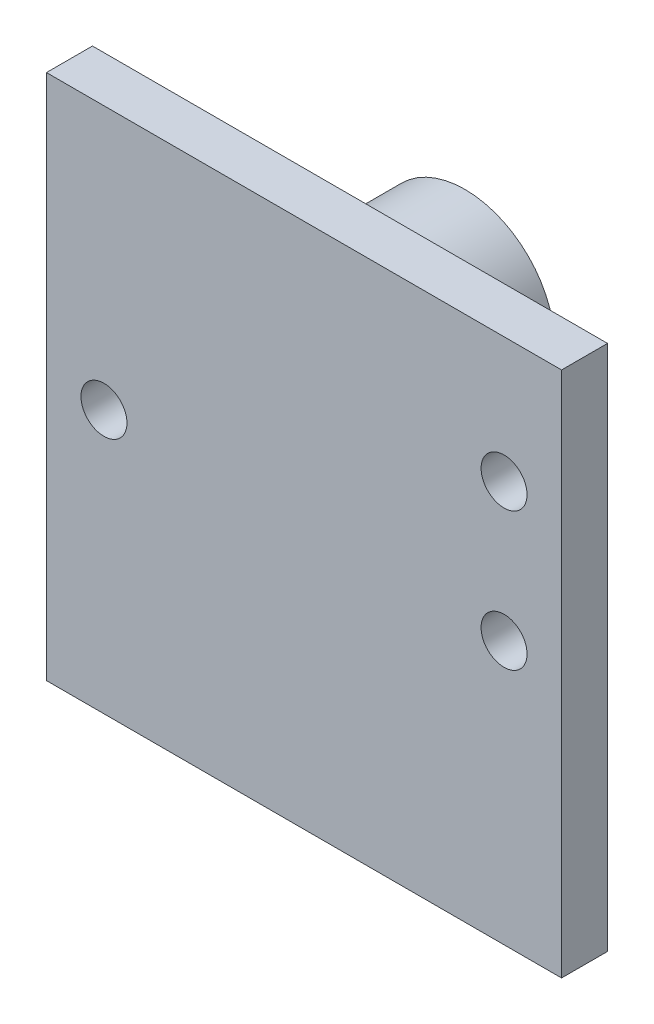
ISO-10303-21;
HEADER;
FILE_DESCRIPTION(('STEP AP214'),'2;1');
FILE_NAME('part.step','',(''),(''),'','','');
FILE_SCHEMA(('AUTOMOTIVE_DESIGN { 1 0 10303 214 1 1 1 1 }'));
ENDSEC;
DATA;
#1=APPLICATION_CONTEXT('core data for automotive mechanical design processes');
#2=APPLICATION_PROTOCOL_DEFINITION('international standard','automotive_design',2000,#1);
#3=PRODUCT_CONTEXT('',#1,'mechanical');
#4=PRODUCT('Part','Part','',(#3));
#5=PRODUCT_RELATED_PRODUCT_CATEGORY('part','',(#4));
#6=PRODUCT_DEFINITION_FORMATION('','',#4);
#7=PRODUCT_DEFINITION_CONTEXT('part definition',#1,'design');
#8=PRODUCT_DEFINITION('design','',#6,#7);
#9=PRODUCT_DEFINITION_SHAPE('','',#8);
#10=(LENGTH_UNIT() NAMED_UNIT(*) SI_UNIT(.MILLI.,.METRE.));
#11=(NAMED_UNIT(*) PLANE_ANGLE_UNIT() SI_UNIT($,.RADIAN.));
#12=(NAMED_UNIT(*) SI_UNIT($,.STERADIAN.) SOLID_ANGLE_UNIT());
#13=UNCERTAINTY_MEASURE_WITH_UNIT(LENGTH_MEASURE(1.E-05),#10,'distance_accuracy_value','');
#14=(GEOMETRIC_REPRESENTATION_CONTEXT(3) GLOBAL_UNCERTAINTY_ASSIGNED_CONTEXT((#13)) GLOBAL_UNIT_ASSIGNED_CONTEXT((#10,
#11,#12)) REPRESENTATION_CONTEXT('',''));
#15=CARTESIAN_POINT('',(0.,0.,0.));
#16=DIRECTION('',(0.,0.,1.));
#17=DIRECTION('',(1.,0.,0.));
#18=AXIS2_PLACEMENT_3D('',#15,#16,#17);
#19=CARTESIAN_POINT('',(11.2,11.45,2.));
#20=DIRECTION('',(-1.,0.,0.));
#21=DIRECTION('',(0.,-1.,0.));
#22=AXIS2_PLACEMENT_3D('',#19,#20,#21);
#23=PLANE('',#22);
#24=DIRECTION('',(0.,1.,0.));
#25=VECTOR('',#24,1.);
#26=CARTESIAN_POINT('',(11.2,11.45,0.));
#27=LINE('',#26,#25);
#28=CARTESIAN_POINT('',(11.2,-11.45,0.));
#29=VERTEX_POINT('',#28);
#30=CARTESIAN_POINT('',(11.2,11.45,0.));
#31=VERTEX_POINT('',#30);
#32=EDGE_CURVE('E112',#29,#31,#27,.T.);
#33=ORIENTED_EDGE('',*,*,#32,.T.);
#34=DIRECTION('',(0.,0.,-1.));
#35=VECTOR('',#34,1.);
#36=CARTESIAN_POINT('',(11.2,11.45,2.));
#37=LINE('',#36,#35);
#38=CARTESIAN_POINT('',(11.2,11.45,2.));
#39=VERTEX_POINT('',#38);
#40=EDGE_CURVE('E50',#39,#31,#37,.T.);
#41=ORIENTED_EDGE('',*,*,#40,.F.);
#42=DIRECTION('',(0.,1.,0.));
#43=VECTOR('',#42,1.);
#44=CARTESIAN_POINT('',(11.2,11.45,2.));
#45=LINE('',#44,#43);
#46=CARTESIAN_POINT('',(11.2,-11.45,2.));
#47=VERTEX_POINT('',#46);
#48=EDGE_CURVE('E94',#47,#39,#45,.T.);
#49=ORIENTED_EDGE('',*,*,#48,.F.);
#50=DIRECTION('',(0.,0.,-1.));
#51=VECTOR('',#50,1.);
#52=CARTESIAN_POINT('',(11.2,-11.45,2.));
#53=LINE('',#52,#51);
#54=EDGE_CURVE('E108',#47,#29,#53,.T.);
#55=ORIENTED_EDGE('',*,*,#54,.T.);
#56=EDGE_LOOP('',(#33,#41,#49,#55));
#57=FACE_BOUND('',#56,.T.);
#58=ADVANCED_FACE('F41',(#57),#23,.F.);
#59=CARTESIAN_POINT('',(-11.2,11.45,2.));
#60=DIRECTION('',(0.,-1.,0.));
#61=DIRECTION('',(0.,0.,-1.));
#62=AXIS2_PLACEMENT_3D('',#59,#60,#61);
#63=PLANE('',#62);
#64=DIRECTION('',(-1.,0.,0.));
#65=VECTOR('',#64,1.);
#66=CARTESIAN_POINT('',(-11.2,11.45,0.));
#67=LINE('',#66,#65);
#68=CARTESIAN_POINT('',(-11.2,11.45,0.));
#69=VERTEX_POINT('',#68);
#70=EDGE_CURVE('E100',#31,#69,#67,.T.);
#71=ORIENTED_EDGE('',*,*,#70,.T.);
#72=DIRECTION('',(0.,0.,-1.));
#73=VECTOR('',#72,1.);
#74=CARTESIAN_POINT('',(-11.2,11.45,2.));
#75=LINE('',#74,#73);
#76=CARTESIAN_POINT('',(-11.2,11.45,2.));
#77=VERTEX_POINT('',#76);
#78=EDGE_CURVE('E98',#77,#69,#75,.T.);
#79=ORIENTED_EDGE('',*,*,#78,.F.);
#80=DIRECTION('',(-1.,0.,0.));
#81=VECTOR('',#80,1.);
#82=CARTESIAN_POINT('',(-11.2,11.45,2.));
#83=LINE('',#82,#81);
#84=EDGE_CURVE('E89',#39,#77,#83,.T.);
#85=ORIENTED_EDGE('',*,*,#84,.F.);
#86=ORIENTED_EDGE('',*,*,#40,.T.);
#87=EDGE_LOOP('',(#71,#79,#85,#86));
#88=FACE_BOUND('',#87,.T.);
#89=ADVANCED_FACE('F99',(#88),#63,.F.);
#90=CARTESIAN_POINT('',(-11.2,11.45,2.));
#91=DIRECTION('',(1.,0.,0.));
#92=DIRECTION('',(0.,1.,0.));
#93=AXIS2_PLACEMENT_3D('',#90,#91,#92);
#94=PLANE('',#93);
#95=DIRECTION('',(0.,-1.,0.));
#96=VECTOR('',#95,1.);
#97=CARTESIAN_POINT('',(-11.2,11.45,0.));
#98=LINE('',#97,#96);
#99=CARTESIAN_POINT('',(-11.2,-11.45,0.));
#100=VERTEX_POINT('',#99);
#101=EDGE_CURVE('E75',#69,#100,#98,.T.);
#102=ORIENTED_EDGE('',*,*,#101,.T.);
#103=DIRECTION('',(0.,0.,-1.));
#104=VECTOR('',#103,1.);
#105=CARTESIAN_POINT('',(-11.2,-11.45,2.));
#106=LINE('',#105,#104);
#107=CARTESIAN_POINT('',(-11.2,-11.45,2.));
#108=VERTEX_POINT('',#107);
#109=EDGE_CURVE('E102',#108,#100,#106,.T.);
#110=ORIENTED_EDGE('',*,*,#109,.F.);
#111=DIRECTION('',(0.,-1.,0.));
#112=VECTOR('',#111,1.);
#113=CARTESIAN_POINT('',(-11.2,11.45,2.));
#114=LINE('',#113,#112);
#115=EDGE_CURVE('E92',#77,#108,#114,.T.);
#116=ORIENTED_EDGE('',*,*,#115,.F.);
#117=ORIENTED_EDGE('',*,*,#78,.T.);
#118=EDGE_LOOP('',(#102,#110,#116,#117));
#119=FACE_BOUND('',#118,.T.);
#120=ADVANCED_FACE('F104',(#119),#94,.F.);
#121=CARTESIAN_POINT('',(-11.2,-11.45,2.));
#122=DIRECTION('',(0.,1.,0.));
#123=DIRECTION('',(0.,0.,1.));
#124=AXIS2_PLACEMENT_3D('',#121,#122,#123);
#125=PLANE('',#124);
#126=DIRECTION('',(1.,0.,0.));
#127=VECTOR('',#126,1.);
#128=CARTESIAN_POINT('',(-11.2,-11.45,0.));
#129=LINE('',#128,#127);
#130=EDGE_CURVE('E81',#100,#29,#129,.T.);
#131=ORIENTED_EDGE('',*,*,#130,.T.);
#132=ORIENTED_EDGE('',*,*,#54,.F.);
#133=DIRECTION('',(1.,0.,0.));
#134=VECTOR('',#133,1.);
#135=CARTESIAN_POINT('',(-11.2,-11.45,2.));
#136=LINE('',#135,#134);
#137=EDGE_CURVE('E58',#108,#47,#136,.T.);
#138=ORIENTED_EDGE('',*,*,#137,.F.);
#139=ORIENTED_EDGE('',*,*,#109,.T.);
#140=EDGE_LOOP('',(#131,#132,#138,#139));
#141=FACE_BOUND('',#140,.T.);
#142=ADVANCED_FACE('F177',(#141),#125,.F.);
#143=CARTESIAN_POINT('',(0.,0.,2.));
#144=DIRECTION('',(0.,0.,1.));
#145=DIRECTION('',(1.,0.,0.));
#146=AXIS2_PLACEMENT_3D('',#143,#144,#145);
#147=PLANE('',#146);
#148=CARTESIAN_POINT('',(-8.7,0.,2.));
#149=DIRECTION('',(0.,0.,1.));
#150=DIRECTION('',(1.,0.,0.));
#151=AXIS2_PLACEMENT_3D('',#148,#149,#150);
#152=CIRCLE('',#151,1.);
#153=CARTESIAN_POINT('',(-7.7,0.,2.));
#154=VERTEX_POINT('',#153);
#155=EDGE_CURVE('E134',#154,#154,#152,.T.);
#156=ORIENTED_EDGE('',*,*,#155,.F.);
#157=EDGE_LOOP('',(#156));
#158=FACE_BOUND('',#157,.T.);
#159=CARTESIAN_POINT('',(8.7,0.,2.));
#160=DIRECTION('',(0.,0.,1.));
#161=DIRECTION('',(1.,0.,0.));
#162=AXIS2_PLACEMENT_3D('',#159,#160,#161);
#163=CIRCLE('',#162,1.);
#164=CARTESIAN_POINT('',(9.7,0.,2.));
#165=VERTEX_POINT('',#164);
#166=EDGE_CURVE('E244',#165,#165,#163,.T.);
#167=ORIENTED_EDGE('',*,*,#166,.F.);
#168=EDGE_LOOP('',(#167));
#169=FACE_BOUND('',#168,.T.);
#170=CARTESIAN_POINT('',(8.7,6.,2.));
#171=DIRECTION('',(0.,0.,1.));
#172=DIRECTION('',(1.,0.,0.));
#173=AXIS2_PLACEMENT_3D('',#170,#171,#172);
#174=CIRCLE('',#173,1.);
#175=CARTESIAN_POINT('',(9.7,6.,2.));
#176=VERTEX_POINT('',#175);
#177=EDGE_CURVE('E240',#176,#176,#174,.T.);
#178=ORIENTED_EDGE('',*,*,#177,.F.);
#179=EDGE_LOOP('',(#178));
#180=FACE_BOUND('',#179,.T.);
#181=ORIENTED_EDGE('',*,*,#48,.T.);
#182=ORIENTED_EDGE('',*,*,#84,.T.);
#183=ORIENTED_EDGE('',*,*,#115,.T.);
#184=ORIENTED_EDGE('',*,*,#137,.T.);
#185=EDGE_LOOP('',(#181,#182,#183,#184));
#186=FACE_BOUND('',#185,.T.);
#187=ADVANCED_FACE('F90',(#158,#169,#180,#186),#147,.T.);
#188=CARTESIAN_POINT('',(0.,0.,0.));
#189=DIRECTION('',(0.,0.,1.));
#190=DIRECTION('',(1.,0.,0.));
#191=AXIS2_PLACEMENT_3D('',#188,#189,#190);
#192=PLANE('',#191);
#193=CARTESIAN_POINT('',(0.,5.25,0.));
#194=DIRECTION('',(0.,0.,1.));
#195=DIRECTION('',(1.,0.,0.));
#196=AXIS2_PLACEMENT_3D('',#193,#194,#195);
#197=CIRCLE('',#196,3.9);
#198=CARTESIAN_POINT('',(3.9,5.25,0.));
#199=VERTEX_POINT('',#198);
#200=EDGE_CURVE('E11',#199,#199,#197,.F.);
#201=ORIENTED_EDGE('',*,*,#200,.F.);
#202=EDGE_LOOP('',(#201));
#203=FACE_BOUND('',#202,.T.);
#204=CARTESIAN_POINT('',(-8.7,0.,0.));
#205=DIRECTION('',(0.,0.,1.));
#206=DIRECTION('',(1.,0.,0.));
#207=AXIS2_PLACEMENT_3D('',#204,#205,#206);
#208=CIRCLE('',#207,1.);
#209=CARTESIAN_POINT('',(-7.7,0.,0.));
#210=VERTEX_POINT('',#209);
#211=EDGE_CURVE('E116',#210,#210,#208,.T.);
#212=ORIENTED_EDGE('',*,*,#211,.T.);
#213=EDGE_LOOP('',(#212));
#214=FACE_BOUND('',#213,.T.);
#215=CARTESIAN_POINT('',(8.7,0.,0.));
#216=DIRECTION('',(0.,0.,1.));
#217=DIRECTION('',(1.,0.,0.));
#218=AXIS2_PLACEMENT_3D('',#215,#216,#217);
#219=CIRCLE('',#218,1.);
#220=CARTESIAN_POINT('',(9.7,0.,0.));
#221=VERTEX_POINT('',#220);
#222=EDGE_CURVE('E133',#221,#221,#219,.T.);
#223=ORIENTED_EDGE('',*,*,#222,.T.);
#224=EDGE_LOOP('',(#223));
#225=FACE_BOUND('',#224,.T.);
#226=CARTESIAN_POINT('',(8.7,6.,0.));
#227=DIRECTION('',(0.,0.,1.));
#228=DIRECTION('',(1.,0.,0.));
#229=AXIS2_PLACEMENT_3D('',#226,#227,#228);
#230=CIRCLE('',#229,1.);
#231=CARTESIAN_POINT('',(9.7,6.,0.));
#232=VERTEX_POINT('',#231);
#233=EDGE_CURVE('E129',#232,#232,#230,.T.);
#234=ORIENTED_EDGE('',*,*,#233,.T.);
#235=EDGE_LOOP('',(#234));
#236=FACE_BOUND('',#235,.T.);
#237=ORIENTED_EDGE('',*,*,#32,.F.);
#238=ORIENTED_EDGE('',*,*,#130,.F.);
#239=ORIENTED_EDGE('',*,*,#101,.F.);
#240=ORIENTED_EDGE('',*,*,#70,.F.);
#241=EDGE_LOOP('',(#237,#238,#239,#240));
#242=FACE_BOUND('',#241,.T.);
#243=ADVANCED_FACE('F141',(#203,#214,#225,#236,#242),#192,.F.);
#244=CARTESIAN_POINT('',(8.7,6.,-3.));
#245=DIRECTION('',(0.,0.,1.));
#246=DIRECTION('',(1.,0.,0.));
#247=AXIS2_PLACEMENT_3D('',#244,#245,#246);
#248=CYLINDRICAL_SURFACE('',#247,1.);
#249=ORIENTED_EDGE('',*,*,#177,.T.);
#250=EDGE_LOOP('',(#249));
#251=FACE_BOUND('',#250,.T.);
#252=ORIENTED_EDGE('',*,*,#233,.F.);
#253=EDGE_LOOP('',(#252));
#254=FACE_BOUND('',#253,.T.);
#255=ADVANCED_FACE('F157',(#251,#254),#248,.F.);
#256=CARTESIAN_POINT('',(8.7,0.,-3.));
#257=DIRECTION('',(0.,0.,1.));
#258=DIRECTION('',(1.,0.,0.));
#259=AXIS2_PLACEMENT_3D('',#256,#257,#258);
#260=CYLINDRICAL_SURFACE('',#259,1.);
#261=ORIENTED_EDGE('',*,*,#166,.T.);
#262=EDGE_LOOP('',(#261));
#263=FACE_BOUND('',#262,.T.);
#264=ORIENTED_EDGE('',*,*,#222,.F.);
#265=EDGE_LOOP('',(#264));
#266=FACE_BOUND('',#265,.T.);
#267=ADVANCED_FACE('F147',(#263,#266),#260,.F.);
#268=CARTESIAN_POINT('',(-8.7,0.,-3.));
#269=DIRECTION('',(0.,0.,1.));
#270=DIRECTION('',(1.,0.,0.));
#271=AXIS2_PLACEMENT_3D('',#268,#269,#270);
#272=CYLINDRICAL_SURFACE('',#271,1.);
#273=ORIENTED_EDGE('',*,*,#155,.T.);
#274=EDGE_LOOP('',(#273));
#275=FACE_BOUND('',#274,.T.);
#276=ORIENTED_EDGE('',*,*,#211,.F.);
#277=EDGE_LOOP('',(#276));
#278=FACE_BOUND('',#277,.T.);
#279=ADVANCED_FACE('F144',(#275,#278),#272,.F.);
#280=CARTESIAN_POINT('',(0.,5.25,-5.));
#281=DIRECTION('',(0.,0.,1.));
#282=DIRECTION('',(1.,0.,0.));
#283=AXIS2_PLACEMENT_3D('',#280,#281,#282);
#284=CYLINDRICAL_SURFACE('',#283,3.9);
#285=CARTESIAN_POINT('',(0.,5.25,-5.));
#286=DIRECTION('',(0.,0.,-1.));
#287=DIRECTION('',(-1.,0.,0.));
#288=AXIS2_PLACEMENT_3D('',#285,#286,#287);
#289=CIRCLE('',#288,3.9);
#290=CARTESIAN_POINT('',(-3.9,5.25,-5.));
#291=VERTEX_POINT('',#290);
#292=EDGE_CURVE('E238',#291,#291,#289,.T.);
#293=ORIENTED_EDGE('',*,*,#292,.F.);
#294=EDGE_LOOP('',(#293));
#295=FACE_BOUND('',#294,.T.);
#296=ORIENTED_EDGE('',*,*,#200,.T.);
#297=EDGE_LOOP('',(#296));
#298=FACE_BOUND('',#297,.T.);
#299=ADVANCED_FACE('F146',(#295,#298),#284,.T.);
#300=CARTESIAN_POINT('',(0.,5.25,-5.));
#301=DIRECTION('',(0.,0.,-1.));
#302=DIRECTION('',(-1.,0.,0.));
#303=AXIS2_PLACEMENT_3D('',#300,#301,#302);
#304=PLANE('',#303);
#305=ORIENTED_EDGE('',*,*,#292,.T.);
#306=EDGE_LOOP('',(#305));
#307=FACE_BOUND('',#306,.T.);
#308=ADVANCED_FACE('F154',(#307),#304,.T.);
#309=CLOSED_SHELL('',(#58,#89,#120,#142,#187,#243,#255,#267,#279,#299,#308));
#310=MANIFOLD_SOLID_BREP('B2',#309);
#311=ADVANCED_BREP_SHAPE_REPRESENTATION('',(#18,#310),#14);
#312=SHAPE_DEFINITION_REPRESENTATION(#9,#311);
ENDSEC;
END-ISO-10303-21;
